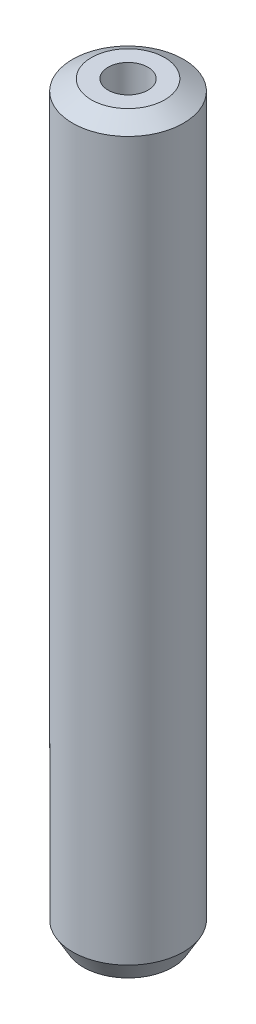
ISO-10303-21;
HEADER;
FILE_DESCRIPTION(('STEP AP214'),'2;1');
FILE_NAME('part.step','',(''),(''),'','','');
FILE_SCHEMA(('AUTOMOTIVE_DESIGN { 1 0 10303 214 1 1 1 1 }'));
ENDSEC;
DATA;
#1=APPLICATION_CONTEXT('core data for automotive mechanical design processes');
#2=APPLICATION_PROTOCOL_DEFINITION('international standard','automotive_design',2000,#1);
#3=PRODUCT_CONTEXT('',#1,'mechanical');
#4=PRODUCT('Part','Part','',(#3));
#5=PRODUCT_RELATED_PRODUCT_CATEGORY('part','',(#4));
#6=PRODUCT_DEFINITION_FORMATION('','',#4);
#7=PRODUCT_DEFINITION_CONTEXT('part definition',#1,'design');
#8=PRODUCT_DEFINITION('design','',#6,#7);
#9=PRODUCT_DEFINITION_SHAPE('','',#8);
#10=(LENGTH_UNIT() NAMED_UNIT(*) SI_UNIT(.MILLI.,.METRE.));
#11=(NAMED_UNIT(*) PLANE_ANGLE_UNIT() SI_UNIT($,.RADIAN.));
#12=(NAMED_UNIT(*) SI_UNIT($,.STERADIAN.) SOLID_ANGLE_UNIT());
#13=UNCERTAINTY_MEASURE_WITH_UNIT(LENGTH_MEASURE(1.E-05),#10,'distance_accuracy_value','');
#14=(GEOMETRIC_REPRESENTATION_CONTEXT(3) GLOBAL_UNCERTAINTY_ASSIGNED_CONTEXT((#13)) GLOBAL_UNIT_ASSIGNED_CONTEXT((#10,
#11,#12)) REPRESENTATION_CONTEXT('',''));
#15=CARTESIAN_POINT('',(0.,0.,0.));
#16=DIRECTION('',(0.,0.,1.));
#17=DIRECTION('',(1.,0.,0.));
#18=AXIS2_PLACEMENT_3D('',#15,#16,#17);
#19=CARTESIAN_POINT('',(0.,235.905462570796,0.));
#20=DIRECTION('',(0.,-1.,0.));
#21=DIRECTION('',(0.,0.,-1.));
#22=AXIS2_PLACEMENT_3D('',#19,#20,#21);
#23=CYLINDRICAL_SURFACE('',#22,17.5);
#24=CARTESIAN_POINT('',(0.,232.480621669358,0.));
#25=DIRECTION('',(0.,1.,0.));
#26=DIRECTION('',(0.,0.,1.));
#27=AXIS2_PLACEMENT_3D('',#24,#25,#26);
#28=CIRCLE('',#27,17.5);
#29=CARTESIAN_POINT('',(0.,232.480621669358,-17.5));
#30=VERTEX_POINT('',#29);
#31=EDGE_CURVE('E50',#30,#30,#28,.F.);
#32=CARTESIAN_POINT('',(0.,5.93199844913023,0.));
#33=DIRECTION('',(0.,1.,0.));
#34=DIRECTION('',(0.,0.,1.));
#35=AXIS2_PLACEMENT_3D('',#32,#33,#34);
#36=CIRCLE('',#35,17.5);
#37=CARTESIAN_POINT('',(0.,5.93199844913023,-17.5));
#38=VERTEX_POINT('',#37);
#39=EDGE_CURVE('E51',#38,#38,#36,.T.);
#40=CARTESIAN_POINT('',(0.,232.480621669358,-17.5));
#41=CARTESIAN_POINT('',(0.,230.120740177481,-17.5));
#42=CARTESIAN_POINT('',(0.,227.760858685603,-17.5));
#43=CARTESIAN_POINT('',(0.,223.041095701849,-17.5));
#44=CARTESIAN_POINT('',(0.,220.681214209971,-17.5));
#45=CARTESIAN_POINT('',(0.,215.961451226216,-17.5));
#46=CARTESIAN_POINT('',(0.,213.601569734339,-17.5));
#47=CARTESIAN_POINT('',(0.,208.881806750584,-17.5));
#48=CARTESIAN_POINT('',(0.,206.521925258707,-17.5));
#49=CARTESIAN_POINT('',(0.,201.802162274952,-17.5));
#50=CARTESIAN_POINT('',(0.,199.442280783075,-17.5));
#51=CARTESIAN_POINT('',(0.,194.72251779932,-17.5));
#52=CARTESIAN_POINT('',(0.,192.362636307443,-17.5));
#53=CARTESIAN_POINT('',(0.,187.642873323688,-17.5));
#54=CARTESIAN_POINT('',(0.,185.282991831811,-17.5));
#55=CARTESIAN_POINT('',(0.,180.563228848056,-17.5));
#56=CARTESIAN_POINT('',(0.,178.203347356178,-17.5));
#57=CARTESIAN_POINT('',(0.,173.483584372424,-17.5));
#58=CARTESIAN_POINT('',(0.,171.123702880546,-17.5));
#59=CARTESIAN_POINT('',(0.,166.403939896792,-17.5));
#60=CARTESIAN_POINT('',(0.,164.044058404914,-17.5));
#61=CARTESIAN_POINT('',(0.,159.324295421159,-17.5));
#62=CARTESIAN_POINT('',(0.,156.964413929282,-17.5));
#63=CARTESIAN_POINT('',(0.,152.244650945527,-17.5));
#64=CARTESIAN_POINT('',(0.,149.88476945365,-17.5));
#65=CARTESIAN_POINT('',(0.,145.165006469895,-17.5));
#66=CARTESIAN_POINT('',(0.,142.805124978018,-17.5));
#67=CARTESIAN_POINT('',(0.,138.085361994263,-17.5));
#68=CARTESIAN_POINT('',(0.,135.725480502386,-17.5));
#69=CARTESIAN_POINT('',(0.,131.005717518631,-17.5));
#70=CARTESIAN_POINT('',(0.,128.645836026754,-17.5));
#71=CARTESIAN_POINT('',(0.,123.926073042999,-17.5));
#72=CARTESIAN_POINT('',(0.,121.566191551122,-17.5));
#73=CARTESIAN_POINT('',(0.,116.846428567367,-17.5));
#74=CARTESIAN_POINT('',(0.,114.486547075489,-17.5));
#75=CARTESIAN_POINT('',(0.,109.766784091735,-17.5));
#76=CARTESIAN_POINT('',(0.,107.406902599857,-17.5));
#77=CARTESIAN_POINT('',(0.,102.687139616103,-17.5));
#78=CARTESIAN_POINT('',(0.,100.327258124225,-17.5));
#79=CARTESIAN_POINT('',(0.,95.6074951404704,-17.5));
#80=CARTESIAN_POINT('',(0.,93.247613648593,-17.5));
#81=CARTESIAN_POINT('',(0.,88.5278506648383,-17.5));
#82=CARTESIAN_POINT('',(0.,86.1679691729609,-17.5));
#83=CARTESIAN_POINT('',(0.,81.4482061892062,-17.5));
#84=CARTESIAN_POINT('',(0.,79.0883246973288,-17.5));
#85=CARTESIAN_POINT('',(0.,74.3685617135741,-17.5));
#86=CARTESIAN_POINT('',(0.,72.0086802216967,-17.5));
#87=CARTESIAN_POINT('',(0.,67.2889172379419,-17.5));
#88=CARTESIAN_POINT('',(0.,64.9290357460646,-17.5));
#89=CARTESIAN_POINT('',(0.,60.2092727623098,-17.5));
#90=CARTESIAN_POINT('',(0.,57.8493912704324,-17.5));
#91=CARTESIAN_POINT('',(0.,53.1296282866777,-17.5));
#92=CARTESIAN_POINT('',(0.,50.7697467948003,-17.5));
#93=CARTESIAN_POINT('',(0.,46.0499838110456,-17.5));
#94=CARTESIAN_POINT('',(0.,43.6901023191682,-17.5));
#95=CARTESIAN_POINT('',(0.,38.9703393354134,-17.5));
#96=CARTESIAN_POINT('',(0.,36.6104578435361,-17.5));
#97=CARTESIAN_POINT('',(0.,31.8906948597813,-17.5));
#98=CARTESIAN_POINT('',(0.,29.530813367904,-17.5));
#99=CARTESIAN_POINT('',(0.,24.8110503841492,-17.5));
#100=CARTESIAN_POINT('',(0.,22.4511688922718,-17.5));
#101=CARTESIAN_POINT('',(0.,17.7314059085171,-17.5));
#102=CARTESIAN_POINT('',(0.,15.3715244166397,-17.5));
#103=CARTESIAN_POINT('',(0.,10.651761432885,-17.5));
#104=CARTESIAN_POINT('',(0.,8.2918799410076,-17.5));
#105=CARTESIAN_POINT('',(0.,5.93199844913023,-17.5));
#106=B_SPLINE_CURVE_WITH_KNOTS('',3,(#40,#41,#42,#43,#44,#45,#46,#47,#48,#49,#50,#51,#52,#53,
#54,#55,#56,#57,#58,#59,#60,#61,#62,#63,#64,#65,#66,#67,#68,#69,#70,#71,#72,#73,#74,#75,#76,#77,
#78,#79,#80,#81,#82,#83,#84,#85,#86,#87,#88,#89,#90,#91,#92,#93,#94,#95,#96,#97,#98,#99,#100,
#101,#102,#103,#104,#105),.UNSPECIFIED.,.F.,.F.,(4,2,2,2,2,2,2,2,2,2,2,2,2,2,2,2,2,2,2,2,2,2,2,
2,2,2,2,2,2,2,2,2,4),(0.,7.07964447563211,14.1592889512642,21.2389334268963,28.3185779025285,
35.3982223781606,42.4778668537927,49.5575113294248,56.6371558050569,63.716800280689,
70.7964447563212,77.8760892319533,84.9557337075854,92.0353781832175,99.1150226588497,
106.194667134482,113.274311610114,120.353956085746,127.433600561378,134.51324503701,
141.592889512642,148.672533988274,155.752178463907,162.831822939539,169.911467415171,
176.991111890803,184.070756366435,191.150400842067,198.230045317699,205.309689793331,
212.389334268964,219.468978744596,226.548623220228),.UNSPECIFIED.);
#107=EDGE_CURVE('BSEAM39',#30,#38,#106,.T.);
#108=ORIENTED_EDGE('',*,*,#31,.T.);
#109=ORIENTED_EDGE('',*,*,#39,.T.);
#110=ORIENTED_EDGE('',*,*,#107,.T.);
#111=ORIENTED_EDGE('',*,*,#107,.F.);
#112=EDGE_LOOP('',(#108,#110,#109,#111));
#113=FACE_BOUND('',#112,.T.);
#114=ADVANCED_FACE('F39',(#113),#23,.T.);
#115=CARTESIAN_POINT('',(0.,235.905462570796,0.));
#116=DIRECTION('',(0.,1.,0.));
#117=DIRECTION('',(0.,0.,1.));
#118=AXIS2_PLACEMENT_3D('',#115,#116,#117);
#119=PLANE('',#118);
#120=CARTESIAN_POINT('',(0.,235.905462570796,0.));
#121=DIRECTION('',(0.,1.,0.));
#122=DIRECTION('',(0.,0.,1.));
#123=AXIS2_PLACEMENT_3D('',#120,#121,#122);
#124=CIRCLE('',#123,11.5680015508703);
#125=CARTESIAN_POINT('',(0.,235.905462570796,11.5680015508703));
#126=VERTEX_POINT('',#125);
#127=EDGE_CURVE('E54',#126,#126,#124,.T.);
#128=ORIENTED_EDGE('',*,*,#127,.T.);
#129=EDGE_LOOP('',(#128));
#130=FACE_BOUND('',#129,.T.);
#131=CARTESIAN_POINT('',(0.,235.905462570796,0.));
#132=DIRECTION('',(0.,1.,0.));
#133=DIRECTION('',(0.,0.,1.));
#134=AXIS2_PLACEMENT_3D('',#131,#132,#133);
#135=CIRCLE('',#134,6.28773341849391);
#136=CARTESIAN_POINT('',(0.,235.905462570796,-6.28773341849391));
#137=VERTEX_POINT('',#136);
#138=EDGE_CURVE('E58',#137,#137,#135,.T.);
#139=ORIENTED_EDGE('',*,*,#138,.F.);
#140=EDGE_LOOP('',(#139));
#141=FACE_BOUND('',#140,.T.);
#142=ADVANCED_FACE('F69',(#130,#141),#119,.T.);
#143=CARTESIAN_POINT('',(0.,0.,0.));
#144=DIRECTION('',(0.,1.,0.));
#145=DIRECTION('',(0.,0.,1.));
#146=AXIS2_PLACEMENT_3D('',#143,#144,#145);
#147=PLANE('',#146);
#148=CARTESIAN_POINT('',(0.,0.,0.));
#149=DIRECTION('',(0.,1.,0.));
#150=DIRECTION('',(0.,0.,1.));
#151=AXIS2_PLACEMENT_3D('',#148,#149,#150);
#152=CIRCLE('',#151,14.0751590985622);
#153=CARTESIAN_POINT('',(0.,0.,14.0751590985622));
#154=VERTEX_POINT('',#153);
#155=EDGE_CURVE('E10',#154,#154,#152,.F.);
#156=ORIENTED_EDGE('',*,*,#155,.T.);
#157=EDGE_LOOP('',(#156));
#158=FACE_BOUND('',#157,.T.);
#159=CARTESIAN_POINT('',(0.,0.,0.));
#160=DIRECTION('',(0.,1.,0.));
#161=DIRECTION('',(0.,0.,1.));
#162=AXIS2_PLACEMENT_3D('',#159,#160,#161);
#163=CIRCLE('',#162,6.28773341849391);
#164=CARTESIAN_POINT('',(0.,0.,-6.28773341849391));
#165=VERTEX_POINT('',#164);
#166=EDGE_CURVE('E63',#165,#165,#163,.T.);
#167=ORIENTED_EDGE('',*,*,#166,.T.);
#168=EDGE_LOOP('',(#167));
#169=FACE_BOUND('',#168,.T.);
#170=ADVANCED_FACE('F75',(#158,#169),#147,.F.);
#171=CARTESIAN_POINT('',(0.,235.905462570796,0.));
#172=DIRECTION('',(0.,-1.,0.));
#173=DIRECTION('',(0.,0.,-1.));
#174=AXIS2_PLACEMENT_3D('',#171,#172,#173);
#175=CYLINDRICAL_SURFACE('',#174,6.28773341849391);
#176=CARTESIAN_POINT('',(0.,235.905462570796,-6.28773341849391));
#177=CARTESIAN_POINT('',(0.,233.44811400235,-6.28773341849391));
#178=CARTESIAN_POINT('',(0.,230.990765433904,-6.28773341849391));
#179=CARTESIAN_POINT('',(0.,226.076068297012,-6.28773341849391));
#180=CARTESIAN_POINT('',(0.,223.618719728567,-6.28773341849391));
#181=CARTESIAN_POINT('',(0.,218.704022591675,-6.28773341849391));
#182=CARTESIAN_POINT('',(0.,216.246674023229,-6.28773341849391));
#183=CARTESIAN_POINT('',(0.,211.331976886338,-6.28773341849391));
#184=CARTESIAN_POINT('',(0.,208.874628317892,-6.28773341849391));
#185=CARTESIAN_POINT('',(0.,203.959931181,-6.28773341849391));
#186=CARTESIAN_POINT('',(0.,201.502582612555,-6.28773341849391));
#187=CARTESIAN_POINT('',(0.,196.587885475663,-6.28773341849391));
#188=CARTESIAN_POINT('',(0.,194.130536907217,-6.28773341849391));
#189=CARTESIAN_POINT('',(0.,189.215839770326,-6.28773341849391));
#190=CARTESIAN_POINT('',(0.,186.75849120188,-6.28773341849391));
#191=CARTESIAN_POINT('',(0.,181.843794064988,-6.28773341849391));
#192=CARTESIAN_POINT('',(0.,179.386445496542,-6.28773341849391));
#193=CARTESIAN_POINT('',(0.,174.471748359651,-6.28773341849391));
#194=CARTESIAN_POINT('',(0.,172.014399791205,-6.28773341849391));
#195=CARTESIAN_POINT('',(0.,167.099702654314,-6.28773341849391));
#196=CARTESIAN_POINT('',(0.,164.642354085868,-6.28773341849391));
#197=CARTESIAN_POINT('',(0.,159.727656948976,-6.28773341849391));
#198=CARTESIAN_POINT('',(0.,157.27030838053,-6.28773341849391));
#199=CARTESIAN_POINT('',(0.,152.355611243639,-6.28773341849391));
#200=CARTESIAN_POINT('',(0.,149.898262675193,-6.28773341849391));
#201=CARTESIAN_POINT('',(0.,144.983565538301,-6.28773341849391));
#202=CARTESIAN_POINT('',(0.,142.526216969856,-6.28773341849391));
#203=CARTESIAN_POINT('',(0.,137.611519832964,-6.28773341849391));
#204=CARTESIAN_POINT('',(0.,135.154171264518,-6.28773341849391));
#205=CARTESIAN_POINT('',(0.,130.239474127627,-6.28773341849391));
#206=CARTESIAN_POINT('',(0.,127.782125559181,-6.28773341849391));
#207=CARTESIAN_POINT('',(0.,122.867428422289,-6.28773341849391));
#208=CARTESIAN_POINT('',(0.,120.410079853844,-6.28773341849391));
#209=CARTESIAN_POINT('',(0.,115.495382716952,-6.28773341849391));
#210=CARTESIAN_POINT('',(0.,113.038034148506,-6.28773341849391));
#211=CARTESIAN_POINT('',(0.,108.123337011615,-6.28773341849391));
#212=CARTESIAN_POINT('',(0.,105.665988443169,-6.28773341849391));
#213=CARTESIAN_POINT('',(0.,100.751291306277,-6.28773341849391));
#214=CARTESIAN_POINT('',(0.,98.2939427378315,-6.28773341849391));
#215=CARTESIAN_POINT('',(0.,93.3792456009399,-6.28773341849391));
#216=CARTESIAN_POINT('',(0.,90.9218970324941,-6.28773341849391));
#217=CARTESIAN_POINT('',(0.,86.0071998956026,-6.28773341849391));
#218=CARTESIAN_POINT('',(0.,83.5498513271568,-6.28773341849391));
#219=CARTESIAN_POINT('',(0.,78.6351541902652,-6.28773341849391));
#220=CARTESIAN_POINT('',(0.,76.1778056218194,-6.28773341849391));
#221=CARTESIAN_POINT('',(0.,71.2631084849278,-6.28773341849391));
#222=CARTESIAN_POINT('',(0.,68.805759916482,-6.28773341849391));
#223=CARTESIAN_POINT('',(0.,63.8910627795905,-6.28773341849391));
#224=CARTESIAN_POINT('',(0.,61.4337142111447,-6.28773341849391));
#225=CARTESIAN_POINT('',(0.,56.5190170742531,-6.28773341849391));
#226=CARTESIAN_POINT('',(0.,54.0616685058073,-6.28773341849391));
#227=CARTESIAN_POINT('',(0.,49.1469713689157,-6.28773341849391));
#228=CARTESIAN_POINT('',(0.,46.68962280047,-6.28773341849391));
#229=CARTESIAN_POINT('',(0.,41.7749256635784,-6.28773341849391));
#230=CARTESIAN_POINT('',(0.,39.3175770951326,-6.28773341849391));
#231=CARTESIAN_POINT('',(0.,34.402879958241,-6.28773341849391));
#232=CARTESIAN_POINT('',(0.,31.9455313897952,-6.28773341849391));
#233=CARTESIAN_POINT('',(0.,27.0308342529037,-6.28773341849391));
#234=CARTESIAN_POINT('',(0.,24.5734856844579,-6.28773341849391));
#235=CARTESIAN_POINT('',(0.,19.6587885475663,-6.28773341849391));
#236=CARTESIAN_POINT('',(0.,17.2014399791205,-6.28773341849391));
#237=CARTESIAN_POINT('',(0.,12.2867428422289,-6.28773341849391));
#238=CARTESIAN_POINT('',(0.,9.82939427378315,-6.28773341849391));
#239=CARTESIAN_POINT('',(0.,4.91469713689158,-6.28773341849391));
#240=CARTESIAN_POINT('',(0.,2.45734856844579,-6.28773341849391));
#241=CARTESIAN_POINT('',(0.,0.,-6.28773341849391));
#242=B_SPLINE_CURVE_WITH_KNOTS('',3,(#176,#177,#178,#179,#180,#181,#182,#183,#184,#185,#186,
#187,#188,#189,#190,#191,#192,#193,#194,#195,#196,#197,#198,#199,#200,#201,#202,#203,#204,#205,
#206,#207,#208,#209,#210,#211,#212,#213,#214,#215,#216,#217,#218,#219,#220,#221,#222,#223,#224,
#225,#226,#227,#228,#229,#230,#231,#232,#233,#234,#235,#236,#237,#238,#239,#240,#241),
.UNSPECIFIED.,.F.,.F.,(4,2,2,2,2,2,2,2,2,2,2,2,2,2,2,2,2,2,2,2,2,2,2,2,2,2,2,2,2,2,2,2,4),(0.,
7.37204570533737,14.7440914106747,22.1161371160121,29.4881828213495,36.8602285266868,
44.2322742320242,51.6043199373615,58.9763656426989,66.3484113480363,73.7204570533736,
81.092502758711,88.4645484640484,95.8365941693857,103.208639874723,110.58068558006,
117.952731285398,125.324776990735,132.696822696073,140.06886840141,147.440914106747,
154.812959812085,162.185005517422,169.557051222759,176.929096928097,184.301142633434,
191.673188338771,199.045234044109,206.417279749446,213.789325454783,221.161371160121,
228.533416865458,235.905462570796),.UNSPECIFIED.);
#243=EDGE_CURVE('BSEAM70',#137,#165,#242,.T.);
#244=ORIENTED_EDGE('',*,*,#138,.T.);
#245=ORIENTED_EDGE('',*,*,#166,.F.);
#246=ORIENTED_EDGE('',*,*,#243,.T.);
#247=ORIENTED_EDGE('',*,*,#243,.F.);
#248=EDGE_LOOP('',(#244,#246,#245,#247));
#249=FACE_BOUND('',#248,.T.);
#250=ADVANCED_FACE('F70',(#249),#175,.F.);
#251=CARTESIAN_POINT('',(0.,235.905462570796,0.));
#252=DIRECTION('',(0.,-1.,0.));
#253=DIRECTION('',(0.,0.,-1.));
#254=AXIS2_PLACEMENT_3D('',#251,#252,#253);
#255=CONICAL_SURFACE('',#254,11.5680015508703,1.04719755119659);
#256=ORIENTED_EDGE('',*,*,#31,.F.);
#257=EDGE_LOOP('',(#256));
#258=FACE_BOUND('',#257,.T.);
#259=ORIENTED_EDGE('',*,*,#127,.F.);
#260=EDGE_LOOP('',(#259));
#261=FACE_BOUND('',#260,.T.);
#262=ADVANCED_FACE('F81',(#258,#261),#255,.T.);
#263=CARTESIAN_POINT('',(0.,5.93199844913023,0.));
#264=DIRECTION('',(0.,1.,0.));
#265=DIRECTION('',(0.,0.,1.));
#266=AXIS2_PLACEMENT_3D('',#263,#264,#265);
#267=CONICAL_SURFACE('',#266,17.5,0.523598775598304);
#268=ORIENTED_EDGE('',*,*,#155,.F.);
#269=EDGE_LOOP('',(#268));
#270=FACE_BOUND('',#269,.T.);
#271=ORIENTED_EDGE('',*,*,#39,.F.);
#272=EDGE_LOOP('',(#271));
#273=FACE_BOUND('',#272,.T.);
#274=ADVANCED_FACE('F45',(#270,#273),#267,.T.);
#275=CLOSED_SHELL('',(#114,#142,#170,#250,#262,#274));
#276=MANIFOLD_SOLID_BREP('B2',#275);
#277=ADVANCED_BREP_SHAPE_REPRESENTATION('',(#18,#276),#14);
#278=SHAPE_DEFINITION_REPRESENTATION(#9,#277);
ENDSEC;
END-ISO-10303-21;
